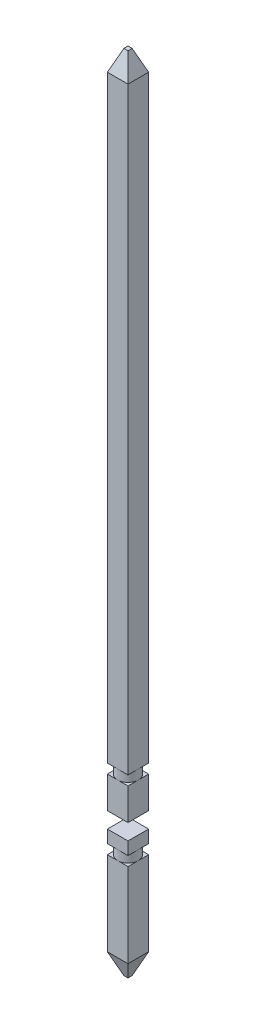
ISO-10303-21;
HEADER;
FILE_DESCRIPTION(('STEP AP214'),'2;1');
FILE_NAME('part.step','',(''),(''),'','','');
FILE_SCHEMA(('AUTOMOTIVE_DESIGN { 1 0 10303 214 1 1 1 1 }'));
ENDSEC;
DATA;
#1=APPLICATION_CONTEXT('core data for automotive mechanical design processes');
#2=APPLICATION_PROTOCOL_DEFINITION('international standard','automotive_design',2000,#1);
#3=PRODUCT_CONTEXT('',#1,'mechanical');
#4=PRODUCT('Part','Part','',(#3));
#5=PRODUCT_RELATED_PRODUCT_CATEGORY('part','',(#4));
#6=PRODUCT_DEFINITION_FORMATION('','',#4);
#7=PRODUCT_DEFINITION_CONTEXT('part definition',#1,'design');
#8=PRODUCT_DEFINITION('design','',#6,#7);
#9=PRODUCT_DEFINITION_SHAPE('','',#8);
#10=(LENGTH_UNIT() NAMED_UNIT(*) SI_UNIT(.MILLI.,.METRE.));
#11=(NAMED_UNIT(*) PLANE_ANGLE_UNIT() SI_UNIT($,.RADIAN.));
#12=(NAMED_UNIT(*) SI_UNIT($,.STERADIAN.) SOLID_ANGLE_UNIT());
#13=UNCERTAINTY_MEASURE_WITH_UNIT(LENGTH_MEASURE(1.E-05),#10,'distance_accuracy_value','');
#14=(GEOMETRIC_REPRESENTATION_CONTEXT(3) GLOBAL_UNCERTAINTY_ASSIGNED_CONTEXT((#13)) GLOBAL_UNIT_ASSIGNED_CONTEXT((#10,
#11,#12)) REPRESENTATION_CONTEXT('',''));
#15=CARTESIAN_POINT('',(0.,0.,0.));
#16=DIRECTION('',(0.,0.,1.));
#17=DIRECTION('',(1.,0.,0.));
#18=AXIS2_PLACEMENT_3D('',#15,#16,#17);
#19=CARTESIAN_POINT('',(-0.325,5.8,-0.325));
#20=DIRECTION('',(0.,1.,0.));
#21=DIRECTION('',(0.,0.,1.));
#22=AXIS2_PLACEMENT_3D('',#19,#20,#21);
#23=PLANE('',#22);
#24=DIRECTION('',(-1.,0.,0.));
#25=VECTOR('',#24,1.);
#26=CARTESIAN_POINT('',(-0.325,5.8,0.325));
#27=LINE('',#26,#25);
#28=CARTESIAN_POINT('',(0.325,5.8,0.325));
#29=VERTEX_POINT('',#28);
#30=CARTESIAN_POINT('',(0.,5.8,0.325));
#31=VERTEX_POINT('',#30);
#32=EDGE_CURVE('E207',#29,#31,#27,.T.);
#33=ORIENTED_EDGE('',*,*,#32,.T.);
#34=CARTESIAN_POINT('',(0.,5.8,0.));
#35=DIRECTION('',(0.,1.,0.));
#36=DIRECTION('',(0.,0.,1.));
#37=AXIS2_PLACEMENT_3D('',#34,#35,#36);
#38=CIRCLE('',#37,0.325);
#39=CARTESIAN_POINT('',(0.325,5.8,0.));
#40=VERTEX_POINT('',#39);
#41=EDGE_CURVE('E190',#31,#40,#38,.T.);
#42=ORIENTED_EDGE('',*,*,#41,.T.);
#43=DIRECTION('',(0.,0.,1.));
#44=VECTOR('',#43,1.);
#45=CARTESIAN_POINT('',(0.325,5.8,-0.325));
#46=LINE('',#45,#44);
#47=EDGE_CURVE('E201',#40,#29,#46,.T.);
#48=ORIENTED_EDGE('',*,*,#47,.T.);
#49=EDGE_LOOP('',(#33,#42,#48));
#50=FACE_BOUND('',#49,.T.);
#51=ADVANCED_FACE('F46',(#50),#23,.F.);
#52=CARTESIAN_POINT('',(0.325,5.8,-0.325));
#53=VERTEX_POINT('',#52);
#54=EDGE_CURVE('E198',#53,#40,#46,.T.);
#55=ORIENTED_EDGE('',*,*,#54,.T.);
#56=CARTESIAN_POINT('',(0.,5.8,-0.325));
#57=VERTEX_POINT('',#56);
#58=EDGE_CURVE('E196',#40,#57,#38,.T.);
#59=ORIENTED_EDGE('',*,*,#58,.T.);
#60=DIRECTION('',(-1.,0.,0.));
#61=VECTOR('',#60,1.);
#62=CARTESIAN_POINT('',(-0.325,5.8,-0.325));
#63=LINE('',#62,#61);
#64=EDGE_CURVE('E211',#53,#57,#63,.T.);
#65=ORIENTED_EDGE('',*,*,#64,.F.);
#66=EDGE_LOOP('',(#55,#59,#65));
#67=FACE_BOUND('',#66,.T.);
#68=ADVANCED_FACE('F295',(#67),#23,.F.);
#69=CARTESIAN_POINT('',(-0.325,5.8,-0.325));
#70=VERTEX_POINT('',#69);
#71=EDGE_CURVE('E215',#57,#70,#63,.T.);
#72=ORIENTED_EDGE('',*,*,#71,.F.);
#73=CARTESIAN_POINT('',(-0.325,5.8,0.));
#74=VERTEX_POINT('',#73);
#75=EDGE_CURVE('E328',#57,#74,#38,.T.);
#76=ORIENTED_EDGE('',*,*,#75,.T.);
#77=DIRECTION('',(0.,0.,1.));
#78=VECTOR('',#77,1.);
#79=CARTESIAN_POINT('',(-0.325,5.8,-0.325));
#80=LINE('',#79,#78);
#81=EDGE_CURVE('E202',#70,#74,#80,.T.);
#82=ORIENTED_EDGE('',*,*,#81,.F.);
#83=EDGE_LOOP('',(#72,#76,#82));
#84=FACE_BOUND('',#83,.T.);
#85=ADVANCED_FACE('F302',(#84),#23,.F.);
#86=CARTESIAN_POINT('',(0.325,25.3,0.325));
#87=DIRECTION('',(-1.,0.,0.));
#88=DIRECTION('',(0.,0.,1.));
#89=AXIS2_PLACEMENT_3D('',#86,#87,#88);
#90=PLANE('',#89);
#91=DIRECTION('',(0.,-1.,0.));
#92=VECTOR('',#91,1.);
#93=CARTESIAN_POINT('',(0.325,25.3,-0.325));
#94=LINE('',#93,#92);
#95=CARTESIAN_POINT('',(0.325,24.65,-0.325));
#96=VERTEX_POINT('',#95);
#97=EDGE_CURVE('E218',#96,#53,#94,.T.);
#98=ORIENTED_EDGE('',*,*,#97,.F.);
#99=DIRECTION('',(0.,0.,1.));
#100=VECTOR('',#99,1.);
#101=CARTESIAN_POINT('',(0.325,24.65,0.325));
#102=LINE('',#101,#100);
#103=CARTESIAN_POINT('',(0.325,24.65,0.325));
#104=VERTEX_POINT('',#103);
#105=EDGE_CURVE('E12',#96,#104,#102,.T.);
#106=ORIENTED_EDGE('',*,*,#105,.T.);
#107=DIRECTION('',(0.,-1.,0.));
#108=VECTOR('',#107,1.);
#109=CARTESIAN_POINT('',(0.325,25.3,0.325));
#110=LINE('',#109,#108);
#111=EDGE_CURVE('E195',#104,#29,#110,.T.);
#112=ORIENTED_EDGE('',*,*,#111,.T.);
#113=ORIENTED_EDGE('',*,*,#47,.F.);
#114=ORIENTED_EDGE('',*,*,#54,.F.);
#115=EDGE_LOOP('',(#98,#106,#112,#113,#114));
#116=FACE_BOUND('',#115,.T.);
#117=ADVANCED_FACE('F317',(#116),#90,.F.);
#118=CARTESIAN_POINT('',(-0.325,25.3,-0.325));
#119=DIRECTION('',(0.,0.,1.));
#120=DIRECTION('',(1.,0.,0.));
#121=AXIS2_PLACEMENT_3D('',#118,#119,#120);
#122=PLANE('',#121);
#123=DIRECTION('',(0.,-1.,0.));
#124=VECTOR('',#123,1.);
#125=CARTESIAN_POINT('',(-0.325,25.3,-0.325));
#126=LINE('',#125,#124);
#127=CARTESIAN_POINT('',(-0.325,24.65,-0.325));
#128=VERTEX_POINT('',#127);
#129=EDGE_CURVE('E214',#128,#70,#126,.T.);
#130=ORIENTED_EDGE('',*,*,#129,.F.);
#131=DIRECTION('',(1.,0.,0.));
#132=VECTOR('',#131,1.);
#133=CARTESIAN_POINT('',(-0.325,24.65,-0.325));
#134=LINE('',#133,#132);
#135=EDGE_CURVE('E230',#128,#96,#134,.T.);
#136=ORIENTED_EDGE('',*,*,#135,.T.);
#137=ORIENTED_EDGE('',*,*,#97,.T.);
#138=ORIENTED_EDGE('',*,*,#64,.T.);
#139=ORIENTED_EDGE('',*,*,#71,.T.);
#140=EDGE_LOOP('',(#130,#136,#137,#138,#139));
#141=FACE_BOUND('',#140,.T.);
#142=ADVANCED_FACE('F322',(#141),#122,.F.);
#143=CARTESIAN_POINT('',(-0.325,25.3,0.325));
#144=DIRECTION('',(1.,0.,0.));
#145=DIRECTION('',(0.,0.,-1.));
#146=AXIS2_PLACEMENT_3D('',#143,#144,#145);
#147=PLANE('',#146);
#148=DIRECTION('',(0.,-1.,0.));
#149=VECTOR('',#148,1.);
#150=CARTESIAN_POINT('',(-0.325,25.3,0.325));
#151=LINE('',#150,#149);
#152=CARTESIAN_POINT('',(-0.325,24.65,0.325));
#153=VERTEX_POINT('',#152);
#154=CARTESIAN_POINT('',(-0.325,5.8,0.325));
#155=VERTEX_POINT('',#154);
#156=EDGE_CURVE('E205',#153,#155,#151,.T.);
#157=ORIENTED_EDGE('',*,*,#156,.F.);
#158=DIRECTION('',(0.,0.,-1.));
#159=VECTOR('',#158,1.);
#160=CARTESIAN_POINT('',(-0.325,24.65,0.325));
#161=LINE('',#160,#159);
#162=EDGE_CURVE('E233',#153,#128,#161,.T.);
#163=ORIENTED_EDGE('',*,*,#162,.T.);
#164=ORIENTED_EDGE('',*,*,#129,.T.);
#165=ORIENTED_EDGE('',*,*,#81,.T.);
#166=EDGE_CURVE('E206',#74,#155,#80,.T.);
#167=ORIENTED_EDGE('',*,*,#166,.T.);
#168=EDGE_LOOP('',(#157,#163,#164,#165,#167));
#169=FACE_BOUND('',#168,.T.);
#170=ADVANCED_FACE('F342',(#169),#147,.F.);
#171=CARTESIAN_POINT('',(-0.325,25.3,0.325));
#172=DIRECTION('',(0.,0.,-1.));
#173=DIRECTION('',(-1.,0.,0.));
#174=AXIS2_PLACEMENT_3D('',#171,#172,#173);
#175=PLANE('',#174);
#176=ORIENTED_EDGE('',*,*,#111,.F.);
#177=DIRECTION('',(-1.,0.,0.));
#178=VECTOR('',#177,1.);
#179=CARTESIAN_POINT('',(-0.325,24.65,0.325));
#180=LINE('',#179,#178);
#181=EDGE_CURVE('E56',#104,#153,#180,.T.);
#182=ORIENTED_EDGE('',*,*,#181,.T.);
#183=ORIENTED_EDGE('',*,*,#156,.T.);
#184=EDGE_CURVE('E210',#31,#155,#27,.T.);
#185=ORIENTED_EDGE('',*,*,#184,.F.);
#186=ORIENTED_EDGE('',*,*,#32,.F.);
#187=EDGE_LOOP('',(#176,#182,#183,#185,#186));
#188=FACE_BOUND('',#187,.T.);
#189=ADVANCED_FACE('F313',(#188),#175,.F.);
#190=CARTESIAN_POINT('',(0.,25.3,0.));
#191=DIRECTION('',(0.,-1.,0.));
#192=DIRECTION('',(0.,0.,-1.));
#193=AXIS2_PLACEMENT_3D('',#190,#191,#192);
#194=PLANE('',#193);
#195=DIRECTION('',(0.,0.,-1.));
#196=VECTOR('',#195,1.);
#197=CARTESIAN_POINT('',(0.065000000000001,25.3,0.));
#198=LINE('',#197,#196);
#199=CARTESIAN_POINT('',(0.065000000000001,25.3,0.065000000000001));
#200=VERTEX_POINT('',#199);
#201=CARTESIAN_POINT('',(0.065000000000001,25.3,-0.065000000000001));
#202=VERTEX_POINT('',#201);
#203=EDGE_CURVE('E221',#200,#202,#198,.T.);
#204=ORIENTED_EDGE('',*,*,#203,.T.);
#205=DIRECTION('',(-1.,0.,0.));
#206=VECTOR('',#205,1.);
#207=CARTESIAN_POINT('',(0.,25.3,-0.065000000000001));
#208=LINE('',#207,#206);
#209=CARTESIAN_POINT('',(-0.065000000000001,25.3,-0.065000000000001));
#210=VERTEX_POINT('',#209);
#211=EDGE_CURVE('E227',#202,#210,#208,.T.);
#212=ORIENTED_EDGE('',*,*,#211,.T.);
#213=DIRECTION('',(0.,0.,1.));
#214=VECTOR('',#213,1.);
#215=CARTESIAN_POINT('',(-0.065000000000001,25.3,0.));
#216=LINE('',#215,#214);
#217=CARTESIAN_POINT('',(-0.065000000000001,25.3,0.065000000000001));
#218=VERTEX_POINT('',#217);
#219=EDGE_CURVE('E225',#210,#218,#216,.T.);
#220=ORIENTED_EDGE('',*,*,#219,.T.);
#221=DIRECTION('',(1.,0.,0.));
#222=VECTOR('',#221,1.);
#223=CARTESIAN_POINT('',(0.,25.3,0.065000000000001));
#224=LINE('',#223,#222);
#225=EDGE_CURVE('E223',#218,#200,#224,.T.);
#226=ORIENTED_EDGE('',*,*,#225,.T.);
#227=EDGE_LOOP('',(#204,#212,#220,#226));
#228=FACE_BOUND('',#227,.T.);
#229=ADVANCED_FACE('F307',(#228),#194,.F.);
#230=ORIENTED_EDGE('',*,*,#166,.F.);
#231=EDGE_CURVE('E197',#74,#31,#38,.T.);
#232=ORIENTED_EDGE('',*,*,#231,.T.);
#233=ORIENTED_EDGE('',*,*,#184,.T.);
#234=EDGE_LOOP('',(#230,#232,#233));
#235=FACE_BOUND('',#234,.T.);
#236=ADVANCED_FACE('F298',(#235),#23,.F.);
#237=CARTESIAN_POINT('',(0.,6.71923881554251,0.));
#238=DIRECTION('',(0.,-1.,0.));
#239=DIRECTION('',(0.,0.,-1.));
#240=AXIS2_PLACEMENT_3D('',#237,#238,#239);
#241=CYLINDRICAL_SURFACE('',#240,0.325);
#242=CARTESIAN_POINT('',(0.,5.5,0.));
#243=DIRECTION('',(0.,1.,0.));
#244=DIRECTION('',(0.,0.,1.));
#245=AXIS2_PLACEMENT_3D('',#242,#243,#244);
#246=CIRCLE('',#245,0.325);
#247=CARTESIAN_POINT('',(0.,5.5,0.325));
#248=VERTEX_POINT('',#247);
#249=CARTESIAN_POINT('',(0.325,5.5,0.));
#250=VERTEX_POINT('',#249);
#251=EDGE_CURVE('E187',#248,#250,#246,.T.);
#252=ORIENTED_EDGE('',*,*,#251,.T.);
#253=CARTESIAN_POINT('',(0.,5.5,-0.325));
#254=VERTEX_POINT('',#253);
#255=EDGE_CURVE('E191',#250,#254,#246,.T.);
#256=ORIENTED_EDGE('',*,*,#255,.T.);
#257=CARTESIAN_POINT('',(-0.325,5.5,0.));
#258=VERTEX_POINT('',#257);
#259=EDGE_CURVE('E153',#254,#258,#246,.T.);
#260=ORIENTED_EDGE('',*,*,#259,.T.);
#261=EDGE_CURVE('E192',#258,#248,#246,.T.);
#262=ORIENTED_EDGE('',*,*,#261,.T.);
#263=EDGE_LOOP('',(#252,#256,#260,#262));
#264=FACE_BOUND('',#263,.T.);
#265=ORIENTED_EDGE('',*,*,#41,.F.);
#266=ORIENTED_EDGE('',*,*,#231,.F.);
#267=ORIENTED_EDGE('',*,*,#75,.F.);
#268=ORIENTED_EDGE('',*,*,#58,.F.);
#269=EDGE_LOOP('',(#265,#266,#267,#268));
#270=FACE_BOUND('',#269,.T.);
#271=ADVANCED_FACE('F276',(#264,#270),#241,.T.);
#272=CARTESIAN_POINT('',(-0.325,5.5,-0.325));
#273=DIRECTION('',(0.,-1.,0.));
#274=DIRECTION('',(0.,0.,-1.));
#275=AXIS2_PLACEMENT_3D('',#272,#273,#274);
#276=PLANE('',#275);
#277=ORIENTED_EDGE('',*,*,#251,.F.);
#278=DIRECTION('',(1.,0.,0.));
#279=VECTOR('',#278,1.);
#280=CARTESIAN_POINT('',(-0.325,5.5,0.325));
#281=LINE('',#280,#279);
#282=CARTESIAN_POINT('',(0.325,5.5,0.325));
#283=VERTEX_POINT('',#282);
#284=EDGE_CURVE('E246',#248,#283,#281,.T.);
#285=ORIENTED_EDGE('',*,*,#284,.T.);
#286=DIRECTION('',(0.,0.,1.));
#287=VECTOR('',#286,1.);
#288=CARTESIAN_POINT('',(0.325,5.5,-0.325));
#289=LINE('',#288,#287);
#290=EDGE_CURVE('E168',#250,#283,#289,.T.);
#291=ORIENTED_EDGE('',*,*,#290,.F.);
#292=EDGE_LOOP('',(#277,#285,#291));
#293=FACE_BOUND('',#292,.T.);
#294=ADVANCED_FACE('F282',(#293),#276,.F.);
#295=ORIENTED_EDGE('',*,*,#255,.F.);
#296=CARTESIAN_POINT('',(0.325,5.5,-0.325));
#297=VERTEX_POINT('',#296);
#298=EDGE_CURVE('E186',#297,#250,#289,.T.);
#299=ORIENTED_EDGE('',*,*,#298,.F.);
#300=DIRECTION('',(1.,0.,0.));
#301=VECTOR('',#300,1.);
#302=CARTESIAN_POINT('',(-0.325,5.5,-0.325));
#303=LINE('',#302,#301);
#304=EDGE_CURVE('E159',#254,#297,#303,.T.);
#305=ORIENTED_EDGE('',*,*,#304,.F.);
#306=EDGE_LOOP('',(#295,#299,#305));
#307=FACE_BOUND('',#306,.T.);
#308=ADVANCED_FACE('F280',(#307),#276,.F.);
#309=ORIENTED_EDGE('',*,*,#259,.F.);
#310=CARTESIAN_POINT('',(-0.325,5.5,-0.325));
#311=VERTEX_POINT('',#310);
#312=EDGE_CURVE('E148',#311,#254,#303,.T.);
#313=ORIENTED_EDGE('',*,*,#312,.F.);
#314=DIRECTION('',(0.,0.,1.));
#315=VECTOR('',#314,1.);
#316=CARTESIAN_POINT('',(-0.325,5.5,-0.325));
#317=LINE('',#316,#315);
#318=EDGE_CURVE('E151',#311,#258,#317,.T.);
#319=ORIENTED_EDGE('',*,*,#318,.T.);
#320=EDGE_LOOP('',(#309,#313,#319));
#321=FACE_BOUND('',#320,.T.);
#322=ADVANCED_FACE('F150',(#321),#276,.F.);
#323=CARTESIAN_POINT('',(-0.325,4.5,-0.325));
#324=DIRECTION('',(0.,1.,0.));
#325=DIRECTION('',(0.,0.,1.));
#326=AXIS2_PLACEMENT_3D('',#323,#324,#325);
#327=PLANE('',#326);
#328=DIRECTION('',(-1.,0.,0.));
#329=VECTOR('',#328,1.);
#330=CARTESIAN_POINT('',(-0.325,4.5,0.325));
#331=LINE('',#330,#329);
#332=CARTESIAN_POINT('',(0.325,4.5,0.325));
#333=VERTEX_POINT('',#332);
#334=CARTESIAN_POINT('',(-0.325,4.5,0.325));
#335=VERTEX_POINT('',#334);
#336=EDGE_CURVE('E183',#333,#335,#331,.T.);
#337=ORIENTED_EDGE('',*,*,#336,.T.);
#338=DIRECTION('',(0.,0.,1.));
#339=VECTOR('',#338,1.);
#340=CARTESIAN_POINT('',(-0.325,4.5,-0.325));
#341=LINE('',#340,#339);
#342=CARTESIAN_POINT('',(-0.325,4.5,-0.325));
#343=VERTEX_POINT('',#342);
#344=EDGE_CURVE('E174',#343,#335,#341,.T.);
#345=ORIENTED_EDGE('',*,*,#344,.F.);
#346=DIRECTION('',(-1.,0.,0.));
#347=VECTOR('',#346,1.);
#348=CARTESIAN_POINT('',(-0.325,4.5,-0.325));
#349=LINE('',#348,#347);
#350=CARTESIAN_POINT('',(0.325,4.5,-0.325));
#351=VERTEX_POINT('',#350);
#352=EDGE_CURVE('E173',#351,#343,#349,.T.);
#353=ORIENTED_EDGE('',*,*,#352,.F.);
#354=DIRECTION('',(0.,0.,1.));
#355=VECTOR('',#354,1.);
#356=CARTESIAN_POINT('',(0.325,4.5,-0.325));
#357=LINE('',#356,#355);
#358=EDGE_CURVE('E261',#351,#333,#357,.T.);
#359=ORIENTED_EDGE('',*,*,#358,.T.);
#360=EDGE_LOOP('',(#337,#345,#353,#359));
#361=FACE_BOUND('',#360,.T.);
#362=ADVANCED_FACE('F267',(#361),#327,.F.);
#363=CARTESIAN_POINT('',(-0.325,25.3,0.325));
#364=DIRECTION('',(0.,0.,-1.));
#365=DIRECTION('',(-1.,0.,0.));
#366=AXIS2_PLACEMENT_3D('',#363,#364,#365);
#367=PLANE('',#366);
#368=DIRECTION('',(0.,-1.,0.));
#369=VECTOR('',#368,1.);
#370=CARTESIAN_POINT('',(0.325,25.3,0.325));
#371=LINE('',#370,#369);
#372=EDGE_CURVE('E184',#283,#333,#371,.T.);
#373=ORIENTED_EDGE('',*,*,#372,.F.);
#374=ORIENTED_EDGE('',*,*,#284,.F.);
#375=CARTESIAN_POINT('',(-0.325,5.5,0.325));
#376=VERTEX_POINT('',#375);
#377=EDGE_CURVE('E251',#376,#248,#281,.T.);
#378=ORIENTED_EDGE('',*,*,#377,.F.);
#379=DIRECTION('',(0.,-1.,0.));
#380=VECTOR('',#379,1.);
#381=CARTESIAN_POINT('',(-0.325,25.3,0.325));
#382=LINE('',#381,#380);
#383=EDGE_CURVE('E176',#376,#335,#382,.T.);
#384=ORIENTED_EDGE('',*,*,#383,.T.);
#385=ORIENTED_EDGE('',*,*,#336,.F.);
#386=EDGE_LOOP('',(#373,#374,#378,#384,#385));
#387=FACE_BOUND('',#386,.T.);
#388=ADVANCED_FACE('F271',(#387),#367,.F.);
#389=CARTESIAN_POINT('',(-0.325,25.3,0.325));
#390=DIRECTION('',(1.,0.,0.));
#391=DIRECTION('',(0.,0.,-1.));
#392=AXIS2_PLACEMENT_3D('',#389,#390,#391);
#393=PLANE('',#392);
#394=ORIENTED_EDGE('',*,*,#383,.F.);
#395=EDGE_CURVE('E158',#258,#376,#317,.T.);
#396=ORIENTED_EDGE('',*,*,#395,.F.);
#397=ORIENTED_EDGE('',*,*,#318,.F.);
#398=DIRECTION('',(0.,-1.,0.));
#399=VECTOR('',#398,1.);
#400=CARTESIAN_POINT('',(-0.325,25.3,-0.325));
#401=LINE('',#400,#399);
#402=EDGE_CURVE('E166',#311,#343,#401,.T.);
#403=ORIENTED_EDGE('',*,*,#402,.T.);
#404=ORIENTED_EDGE('',*,*,#344,.T.);
#405=EDGE_LOOP('',(#394,#396,#397,#403,#404));
#406=FACE_BOUND('',#405,.T.);
#407=ADVANCED_FACE('F164',(#406),#393,.F.);
#408=CARTESIAN_POINT('',(-0.325,25.3,-0.325));
#409=DIRECTION('',(0.,0.,1.));
#410=DIRECTION('',(1.,0.,0.));
#411=AXIS2_PLACEMENT_3D('',#408,#409,#410);
#412=PLANE('',#411);
#413=ORIENTED_EDGE('',*,*,#402,.F.);
#414=ORIENTED_EDGE('',*,*,#312,.T.);
#415=ORIENTED_EDGE('',*,*,#304,.T.);
#416=DIRECTION('',(0.,-1.,0.));
#417=VECTOR('',#416,1.);
#418=CARTESIAN_POINT('',(0.325,25.3,-0.325));
#419=LINE('',#418,#417);
#420=EDGE_CURVE('E178',#297,#351,#419,.T.);
#421=ORIENTED_EDGE('',*,*,#420,.T.);
#422=ORIENTED_EDGE('',*,*,#352,.T.);
#423=EDGE_LOOP('',(#413,#414,#415,#421,#422));
#424=FACE_BOUND('',#423,.T.);
#425=ADVANCED_FACE('F171',(#424),#412,.F.);
#426=CARTESIAN_POINT('',(0.325,25.3,0.325));
#427=DIRECTION('',(-1.,0.,0.));
#428=DIRECTION('',(0.,0.,1.));
#429=AXIS2_PLACEMENT_3D('',#426,#427,#428);
#430=PLANE('',#429);
#431=ORIENTED_EDGE('',*,*,#420,.F.);
#432=ORIENTED_EDGE('',*,*,#298,.T.);
#433=ORIENTED_EDGE('',*,*,#290,.T.);
#434=ORIENTED_EDGE('',*,*,#372,.T.);
#435=ORIENTED_EDGE('',*,*,#358,.F.);
#436=EDGE_LOOP('',(#431,#432,#433,#434,#435));
#437=FACE_BOUND('',#436,.T.);
#438=ADVANCED_FACE('F284',(#437),#430,.F.);
#439=ORIENTED_EDGE('',*,*,#261,.F.);
#440=ORIENTED_EDGE('',*,*,#395,.T.);
#441=ORIENTED_EDGE('',*,*,#377,.T.);
#442=EDGE_LOOP('',(#439,#440,#441));
#443=FACE_BOUND('',#442,.T.);
#444=ADVANCED_FACE('F273',(#443),#276,.F.);
#445=CARTESIAN_POINT('',(0.,25.3,0.065000000000001));
#446=DIRECTION('',(0.,-0.3713906763541,-0.928476690885261));
#447=DIRECTION('',(1.,0.,0.));
#448=AXIS2_PLACEMENT_3D('',#445,#446,#447);
#449=PLANE('',#448);
#450=DIRECTION('',(-0.348155311911393,-0.870388279778491,0.348155311911393));
#451=VECTOR('',#450,1.);
#452=CARTESIAN_POINT('',(-0.0571212121212132,25.319696969697,0.0571212121212132));
#453=LINE('',#452,#451);
#454=EDGE_CURVE('E239',#153,#218,#453,.F.);
#455=ORIENTED_EDGE('',*,*,#454,.F.);
#456=ORIENTED_EDGE('',*,*,#181,.F.);
#457=DIRECTION('',(0.348155311911393,-0.870388279778491,0.348155311911393));
#458=VECTOR('',#457,1.);
#459=CARTESIAN_POINT('',(0.0571212121212132,25.319696969697,0.0571212121212132));
#460=LINE('',#459,#458);
#461=EDGE_CURVE('E51',#200,#104,#460,.T.);
#462=ORIENTED_EDGE('',*,*,#461,.F.);
#463=ORIENTED_EDGE('',*,*,#225,.F.);
#464=EDGE_LOOP('',(#455,#456,#462,#463));
#465=FACE_BOUND('',#464,.T.);
#466=ADVANCED_FACE('F49',(#465),#449,.F.);
#467=CARTESIAN_POINT('',(0.065000000000001,25.3,0.));
#468=DIRECTION('',(-0.928476690885261,-0.3713906763541,0.));
#469=DIRECTION('',(0.,0.,-1.));
#470=AXIS2_PLACEMENT_3D('',#467,#468,#469);
#471=PLANE('',#470);
#472=ORIENTED_EDGE('',*,*,#461,.T.);
#473=ORIENTED_EDGE('',*,*,#105,.F.);
#474=DIRECTION('',(-0.348155311911393,0.870388279778491,0.348155311911393));
#475=VECTOR('',#474,1.);
#476=CARTESIAN_POINT('',(0.0571212121212132,25.319696969697,-0.0571212121212132));
#477=LINE('',#476,#475);
#478=EDGE_CURVE('E238',#202,#96,#477,.F.);
#479=ORIENTED_EDGE('',*,*,#478,.F.);
#480=ORIENTED_EDGE('',*,*,#203,.F.);
#481=EDGE_LOOP('',(#472,#473,#479,#480));
#482=FACE_BOUND('',#481,.T.);
#483=ADVANCED_FACE('F351',(#482),#471,.F.);
#484=CARTESIAN_POINT('',(-0.065000000000001,25.3,0.));
#485=DIRECTION('',(0.928476690885261,-0.3713906763541,0.));
#486=DIRECTION('',(0.,0.,1.));
#487=AXIS2_PLACEMENT_3D('',#484,#485,#486);
#488=PLANE('',#487);
#489=ORIENTED_EDGE('',*,*,#454,.T.);
#490=ORIENTED_EDGE('',*,*,#219,.F.);
#491=DIRECTION('',(-0.348155311911393,-0.870388279778491,-0.348155311911393));
#492=VECTOR('',#491,1.);
#493=CARTESIAN_POINT('',(-0.0571212121212132,25.319696969697,-0.0571212121212132));
#494=LINE('',#493,#492);
#495=EDGE_CURVE('E236',#128,#210,#494,.F.);
#496=ORIENTED_EDGE('',*,*,#495,.F.);
#497=ORIENTED_EDGE('',*,*,#162,.F.);
#498=EDGE_LOOP('',(#489,#490,#496,#497));
#499=FACE_BOUND('',#498,.T.);
#500=ADVANCED_FACE('F349',(#499),#488,.F.);
#501=CARTESIAN_POINT('',(0.,25.3,-0.065000000000001));
#502=DIRECTION('',(0.,-0.3713906763541,0.928476690885261));
#503=DIRECTION('',(-1.,0.,0.));
#504=AXIS2_PLACEMENT_3D('',#501,#502,#503);
#505=PLANE('',#504);
#506=ORIENTED_EDGE('',*,*,#478,.T.);
#507=ORIENTED_EDGE('',*,*,#135,.F.);
#508=ORIENTED_EDGE('',*,*,#495,.T.);
#509=ORIENTED_EDGE('',*,*,#211,.F.);
#510=EDGE_LOOP('',(#506,#507,#508,#509));
#511=FACE_BOUND('',#510,.T.);
#512=ADVANCED_FACE('F346',(#511),#505,.F.);
#513=CLOSED_SHELL('',(#51,#68,#85,#117,#142,#170,#189,#229,#236,#271,#294,#308,#322,#362,#388,
#407,#425,#438,#444,#466,#483,#500,#512));
#514=MANIFOLD_SOLID_BREP('B2',#513);
#515=CARTESIAN_POINT('',(-0.325,3.3,-0.325));
#516=DIRECTION('',(0.,-1.,0.));
#517=DIRECTION('',(0.,0.,-1.));
#518=AXIS2_PLACEMENT_3D('',#515,#516,#517);
#519=PLANE('',#518);
#520=CARTESIAN_POINT('',(0.,3.3,0.));
#521=DIRECTION('',(0.,1.,0.));
#522=DIRECTION('',(0.,0.,1.));
#523=AXIS2_PLACEMENT_3D('',#520,#521,#522);
#524=CIRCLE('',#523,0.325);
#525=CARTESIAN_POINT('',(0.,3.3,0.325));
#526=VERTEX_POINT('',#525);
#527=CARTESIAN_POINT('',(0.325,3.3,0.));
#528=VERTEX_POINT('',#527);
#529=EDGE_CURVE('E641',#526,#528,#524,.T.);
#530=ORIENTED_EDGE('',*,*,#529,.F.);
#531=DIRECTION('',(1.,0.,0.));
#532=VECTOR('',#531,1.);
#533=CARTESIAN_POINT('',(-0.325,3.3,0.325));
#534=LINE('',#533,#532);
#535=CARTESIAN_POINT('',(0.325,3.3,0.325));
#536=VERTEX_POINT('',#535);
#537=EDGE_CURVE('E670',#526,#536,#534,.T.);
#538=ORIENTED_EDGE('',*,*,#537,.T.);
#539=DIRECTION('',(0.,0.,1.));
#540=VECTOR('',#539,1.);
#541=CARTESIAN_POINT('',(0.325,3.3,-0.325));
#542=LINE('',#541,#540);
#543=EDGE_CURVE('E682',#528,#536,#542,.T.);
#544=ORIENTED_EDGE('',*,*,#543,.F.);
#545=EDGE_LOOP('',(#530,#538,#544));
#546=FACE_BOUND('',#545,.T.);
#547=ADVANCED_FACE('F516',(#546),#519,.F.);
#548=CARTESIAN_POINT('',(0.,3.3,-0.325));
#549=VERTEX_POINT('',#548);
#550=EDGE_CURVE('E665',#528,#549,#524,.T.);
#551=ORIENTED_EDGE('',*,*,#550,.F.);
#552=CARTESIAN_POINT('',(0.325,3.3,-0.325));
#553=VERTEX_POINT('',#552);
#554=EDGE_CURVE('E678',#553,#528,#542,.T.);
#555=ORIENTED_EDGE('',*,*,#554,.F.);
#556=DIRECTION('',(1.,0.,0.));
#557=VECTOR('',#556,1.);
#558=CARTESIAN_POINT('',(-0.325,3.3,-0.325));
#559=LINE('',#558,#557);
#560=EDGE_CURVE('E675',#549,#553,#559,.T.);
#561=ORIENTED_EDGE('',*,*,#560,.F.);
#562=EDGE_LOOP('',(#551,#555,#561));
#563=FACE_BOUND('',#562,.T.);
#564=ADVANCED_FACE('F754',(#563),#519,.F.);
#565=CARTESIAN_POINT('',(-0.325,3.3,0.));
#566=VERTEX_POINT('',#565);
#567=EDGE_CURVE('E743',#549,#566,#524,.T.);
#568=ORIENTED_EDGE('',*,*,#567,.F.);
#569=CARTESIAN_POINT('',(-0.325,3.3,-0.325));
#570=VERTEX_POINT('',#569);
#571=EDGE_CURVE('E671',#570,#549,#559,.T.);
#572=ORIENTED_EDGE('',*,*,#571,.F.);
#573=DIRECTION('',(0.,0.,1.));
#574=VECTOR('',#573,1.);
#575=CARTESIAN_POINT('',(-0.325,3.3,-0.325));
#576=LINE('',#575,#574);
#577=EDGE_CURVE('E683',#570,#566,#576,.T.);
#578=ORIENTED_EDGE('',*,*,#577,.T.);
#579=EDGE_LOOP('',(#568,#572,#578));
#580=FACE_BOUND('',#579,.T.);
#581=ADVANCED_FACE('F742',(#580),#519,.F.);
#582=CARTESIAN_POINT('',(0.,0.,0.));
#583=DIRECTION('',(0.,-1.,0.));
#584=DIRECTION('',(0.,0.,-1.));
#585=AXIS2_PLACEMENT_3D('',#582,#583,#584);
#586=PLANE('',#585);
#587=DIRECTION('',(0.,0.,-1.));
#588=VECTOR('',#587,1.);
#589=CARTESIAN_POINT('',(-0.0649999999999997,0.,-0.325));
#590=LINE('',#589,#588);
#591=CARTESIAN_POINT('',(-0.0649999999999997,0.,0.0649999999999997));
#592=VERTEX_POINT('',#591);
#593=CARTESIAN_POINT('',(-0.0649999999999997,0.,-0.0649999999999997));
#594=VERTEX_POINT('',#593);
#595=EDGE_CURVE('E701',#592,#594,#590,.T.);
#596=ORIENTED_EDGE('',*,*,#595,.T.);
#597=DIRECTION('',(1.,0.,0.));
#598=VECTOR('',#597,1.);
#599=CARTESIAN_POINT('',(0.325,0.,-0.0649999999999997));
#600=LINE('',#599,#598);
#601=CARTESIAN_POINT('',(0.0649999999999997,0.,-0.0649999999999997));
#602=VERTEX_POINT('',#601);
#603=EDGE_CURVE('E703',#594,#602,#600,.T.);
#604=ORIENTED_EDGE('',*,*,#603,.T.);
#605=DIRECTION('',(0.,0.,1.));
#606=VECTOR('',#605,1.);
#607=CARTESIAN_POINT('',(0.0649999999999997,0.,0.325));
#608=LINE('',#607,#606);
#609=CARTESIAN_POINT('',(0.0649999999999997,0.,0.0649999999999997));
#610=VERTEX_POINT('',#609);
#611=EDGE_CURVE('E697',#602,#610,#608,.T.);
#612=ORIENTED_EDGE('',*,*,#611,.T.);
#613=DIRECTION('',(-1.,0.,0.));
#614=VECTOR('',#613,1.);
#615=CARTESIAN_POINT('',(-0.325,0.,0.0649999999999997));
#616=LINE('',#615,#614);
#617=EDGE_CURVE('E699',#610,#592,#616,.T.);
#618=ORIENTED_EDGE('',*,*,#617,.T.);
#619=EDGE_LOOP('',(#596,#604,#612,#618));
#620=FACE_BOUND('',#619,.T.);
#621=ADVANCED_FACE('F726',(#620),#586,.T.);
#622=CARTESIAN_POINT('',(0.325,25.3,0.325));
#623=DIRECTION('',(-1.,0.,0.));
#624=DIRECTION('',(0.,0.,1.));
#625=AXIS2_PLACEMENT_3D('',#622,#623,#624);
#626=PLANE('',#625);
#627=DIRECTION('',(0.,-1.,0.));
#628=VECTOR('',#627,1.);
#629=CARTESIAN_POINT('',(0.325,25.3,0.325));
#630=LINE('',#629,#628);
#631=CARTESIAN_POINT('',(0.325,0.650000000000005,0.325));
#632=VERTEX_POINT('',#631);
#633=EDGE_CURVE('E681',#536,#632,#630,.T.);
#634=ORIENTED_EDGE('',*,*,#633,.T.);
#635=DIRECTION('',(0.,0.,-1.));
#636=VECTOR('',#635,1.);
#637=CARTESIAN_POINT('',(0.325,0.650000000000005,-0.325));
#638=LINE('',#637,#636);
#639=CARTESIAN_POINT('',(0.325,0.650000000000005,-0.325));
#640=VERTEX_POINT('',#639);
#641=EDGE_CURVE('E44',#632,#640,#638,.T.);
#642=ORIENTED_EDGE('',*,*,#641,.T.);
#643=DIRECTION('',(0.,-1.,0.));
#644=VECTOR('',#643,1.);
#645=CARTESIAN_POINT('',(0.325,25.3,-0.325));
#646=LINE('',#645,#644);
#647=EDGE_CURVE('E691',#553,#640,#646,.T.);
#648=ORIENTED_EDGE('',*,*,#647,.F.);
#649=ORIENTED_EDGE('',*,*,#554,.T.);
#650=ORIENTED_EDGE('',*,*,#543,.T.);
#651=EDGE_LOOP('',(#634,#642,#648,#649,#650));
#652=FACE_BOUND('',#651,.T.);
#653=ADVANCED_FACE('F759',(#652),#626,.F.);
#654=CARTESIAN_POINT('',(-0.325,25.3,-0.325));
#655=DIRECTION('',(0.,0.,1.));
#656=DIRECTION('',(1.,0.,0.));
#657=AXIS2_PLACEMENT_3D('',#654,#655,#656);
#658=PLANE('',#657);
#659=ORIENTED_EDGE('',*,*,#647,.T.);
#660=DIRECTION('',(-1.,0.,0.));
#661=VECTOR('',#660,1.);
#662=CARTESIAN_POINT('',(-0.325,0.650000000000005,-0.325));
#663=LINE('',#662,#661);
#664=CARTESIAN_POINT('',(-0.325,0.650000000000005,-0.325));
#665=VERTEX_POINT('',#664);
#666=EDGE_CURVE('E694',#640,#665,#663,.T.);
#667=ORIENTED_EDGE('',*,*,#666,.T.);
#668=DIRECTION('',(0.,-1.,0.));
#669=VECTOR('',#668,1.);
#670=CARTESIAN_POINT('',(-0.325,25.3,-0.325));
#671=LINE('',#670,#669);
#672=EDGE_CURVE('E689',#570,#665,#671,.T.);
#673=ORIENTED_EDGE('',*,*,#672,.F.);
#674=ORIENTED_EDGE('',*,*,#571,.T.);
#675=ORIENTED_EDGE('',*,*,#560,.T.);
#676=EDGE_LOOP('',(#659,#667,#673,#674,#675));
#677=FACE_BOUND('',#676,.T.);
#678=ADVANCED_FACE('F735',(#677),#658,.F.);
#679=CARTESIAN_POINT('',(-0.325,25.3,0.325));
#680=DIRECTION('',(1.,0.,0.));
#681=DIRECTION('',(0.,0.,-1.));
#682=AXIS2_PLACEMENT_3D('',#679,#680,#681);
#683=PLANE('',#682);
#684=ORIENTED_EDGE('',*,*,#672,.T.);
#685=DIRECTION('',(0.,0.,1.));
#686=VECTOR('',#685,1.);
#687=CARTESIAN_POINT('',(-0.325,0.650000000000005,0.325));
#688=LINE('',#687,#686);
#689=CARTESIAN_POINT('',(-0.325,0.650000000000005,0.325));
#690=VERTEX_POINT('',#689);
#691=EDGE_CURVE('E541',#665,#690,#688,.T.);
#692=ORIENTED_EDGE('',*,*,#691,.T.);
#693=DIRECTION('',(0.,-1.,0.));
#694=VECTOR('',#693,1.);
#695=CARTESIAN_POINT('',(-0.325,25.3,0.325));
#696=LINE('',#695,#694);
#697=CARTESIAN_POINT('',(-0.325,3.3,0.325));
#698=VERTEX_POINT('',#697);
#699=EDGE_CURVE('E687',#698,#690,#696,.T.);
#700=ORIENTED_EDGE('',*,*,#699,.F.);
#701=EDGE_CURVE('E674',#566,#698,#576,.T.);
#702=ORIENTED_EDGE('',*,*,#701,.F.);
#703=ORIENTED_EDGE('',*,*,#577,.F.);
#704=EDGE_LOOP('',(#684,#692,#700,#702,#703));
#705=FACE_BOUND('',#704,.T.);
#706=ADVANCED_FACE('F738',(#705),#683,.F.);
#707=CARTESIAN_POINT('',(-0.325,25.3,0.325));
#708=DIRECTION('',(0.,0.,-1.));
#709=DIRECTION('',(-1.,0.,0.));
#710=AXIS2_PLACEMENT_3D('',#707,#708,#709);
#711=PLANE('',#710);
#712=ORIENTED_EDGE('',*,*,#699,.T.);
#713=DIRECTION('',(1.,0.,0.));
#714=VECTOR('',#713,1.);
#715=CARTESIAN_POINT('',(0.325,0.650000000000005,0.325));
#716=LINE('',#715,#714);
#717=EDGE_CURVE('E526',#690,#632,#716,.T.);
#718=ORIENTED_EDGE('',*,*,#717,.T.);
#719=ORIENTED_EDGE('',*,*,#633,.F.);
#720=ORIENTED_EDGE('',*,*,#537,.F.);
#721=EDGE_CURVE('E676',#698,#526,#534,.T.);
#722=ORIENTED_EDGE('',*,*,#721,.F.);
#723=EDGE_LOOP('',(#712,#718,#719,#720,#722));
#724=FACE_BOUND('',#723,.T.);
#725=ADVANCED_FACE('F760',(#724),#711,.F.);
#726=EDGE_CURVE('E666',#566,#526,#524,.T.);
#727=ORIENTED_EDGE('',*,*,#726,.F.);
#728=ORIENTED_EDGE('',*,*,#701,.T.);
#729=ORIENTED_EDGE('',*,*,#721,.T.);
#730=EDGE_LOOP('',(#727,#728,#729));
#731=FACE_BOUND('',#730,.T.);
#732=ADVANCED_FACE('F763',(#731),#519,.F.);
#733=CARTESIAN_POINT('',(0.,4.51923881554251,0.));
#734=DIRECTION('',(0.,-1.,0.));
#735=DIRECTION('',(0.,0.,-1.));
#736=AXIS2_PLACEMENT_3D('',#733,#734,#735);
#737=CYLINDRICAL_SURFACE('',#736,0.325);
#738=ORIENTED_EDGE('',*,*,#529,.T.);
#739=ORIENTED_EDGE('',*,*,#550,.T.);
#740=ORIENTED_EDGE('',*,*,#567,.T.);
#741=ORIENTED_EDGE('',*,*,#726,.T.);
#742=EDGE_LOOP('',(#738,#739,#740,#741));
#743=FACE_BOUND('',#742,.T.);
#744=CARTESIAN_POINT('',(0.,3.6,0.));
#745=DIRECTION('',(0.,1.,0.));
#746=DIRECTION('',(0.,0.,1.));
#747=AXIS2_PLACEMENT_3D('',#744,#745,#746);
#748=CIRCLE('',#747,0.325);
#749=CARTESIAN_POINT('',(0.,3.6,0.325));
#750=VERTEX_POINT('',#749);
#751=CARTESIAN_POINT('',(0.325,3.6,0.));
#752=VERTEX_POINT('',#751);
#753=EDGE_CURVE('E667',#750,#752,#748,.T.);
#754=ORIENTED_EDGE('',*,*,#753,.F.);
#755=CARTESIAN_POINT('',(-0.325,3.6,0.));
#756=VERTEX_POINT('',#755);
#757=EDGE_CURVE('E664',#756,#750,#748,.T.);
#758=ORIENTED_EDGE('',*,*,#757,.F.);
#759=CARTESIAN_POINT('',(0.,3.6,-0.325));
#760=VERTEX_POINT('',#759);
#761=EDGE_CURVE('E983',#760,#756,#748,.T.);
#762=ORIENTED_EDGE('',*,*,#761,.F.);
#763=EDGE_CURVE('E626',#752,#760,#748,.T.);
#764=ORIENTED_EDGE('',*,*,#763,.F.);
#765=EDGE_LOOP('',(#754,#758,#762,#764));
#766=FACE_BOUND('',#765,.T.);
#767=ADVANCED_FACE('F748',(#743,#766),#737,.T.);
#768=CARTESIAN_POINT('',(-0.325,3.6,-0.325));
#769=DIRECTION('',(0.,1.,0.));
#770=DIRECTION('',(0.,0.,1.));
#771=AXIS2_PLACEMENT_3D('',#768,#769,#770);
#772=PLANE('',#771);
#773=DIRECTION('',(-1.,0.,0.));
#774=VECTOR('',#773,1.);
#775=CARTESIAN_POINT('',(-0.325,3.6,0.325));
#776=LINE('',#775,#774);
#777=CARTESIAN_POINT('',(0.325,3.6,0.325));
#778=VERTEX_POINT('',#777);
#779=EDGE_CURVE('E974',#778,#750,#776,.T.);
#780=ORIENTED_EDGE('',*,*,#779,.T.);
#781=ORIENTED_EDGE('',*,*,#753,.T.);
#782=DIRECTION('',(0.,0.,1.));
#783=VECTOR('',#782,1.);
#784=CARTESIAN_POINT('',(0.325,3.6,-0.325));
#785=LINE('',#784,#783);
#786=EDGE_CURVE('E640',#752,#778,#785,.T.);
#787=ORIENTED_EDGE('',*,*,#786,.T.);
#788=EDGE_LOOP('',(#780,#781,#787));
#789=FACE_BOUND('',#788,.T.);
#790=ADVANCED_FACE('F770',(#789),#772,.F.);
#791=CARTESIAN_POINT('',(0.325,3.6,-0.325));
#792=VERTEX_POINT('',#791);
#793=EDGE_CURVE('E625',#792,#752,#785,.T.);
#794=ORIENTED_EDGE('',*,*,#793,.T.);
#795=ORIENTED_EDGE('',*,*,#763,.T.);
#796=DIRECTION('',(-1.,0.,0.));
#797=VECTOR('',#796,1.);
#798=CARTESIAN_POINT('',(-0.325,3.6,-0.325));
#799=LINE('',#798,#797);
#800=EDGE_CURVE('E622',#792,#760,#799,.T.);
#801=ORIENTED_EDGE('',*,*,#800,.F.);
#802=EDGE_LOOP('',(#794,#795,#801));
#803=FACE_BOUND('',#802,.T.);
#804=ADVANCED_FACE('F624',(#803),#772,.F.);
#805=CARTESIAN_POINT('',(-0.325,3.6,-0.325));
#806=VERTEX_POINT('',#805);
#807=EDGE_CURVE('E631',#760,#806,#799,.T.);
#808=ORIENTED_EDGE('',*,*,#807,.F.);
#809=ORIENTED_EDGE('',*,*,#761,.T.);
#810=DIRECTION('',(0.,0.,1.));
#811=VECTOR('',#810,1.);
#812=CARTESIAN_POINT('',(-0.325,3.6,-0.325));
#813=LINE('',#812,#811);
#814=EDGE_CURVE('E646',#806,#756,#813,.T.);
#815=ORIENTED_EDGE('',*,*,#814,.F.);
#816=EDGE_LOOP('',(#808,#809,#815));
#817=FACE_BOUND('',#816,.T.);
#818=ADVANCED_FACE('F809',(#817),#772,.F.);
#819=CARTESIAN_POINT('',(-0.325,3.6,0.325));
#820=VERTEX_POINT('',#819);
#821=EDGE_CURVE('E649',#756,#820,#813,.T.);
#822=ORIENTED_EDGE('',*,*,#821,.F.);
#823=ORIENTED_EDGE('',*,*,#757,.T.);
#824=EDGE_CURVE('E976',#750,#820,#776,.T.);
#825=ORIENTED_EDGE('',*,*,#824,.T.);
#826=EDGE_LOOP('',(#822,#823,#825));
#827=FACE_BOUND('',#826,.T.);
#828=ADVANCED_FACE('F801',(#827),#772,.F.);
#829=CARTESIAN_POINT('',(-0.325,25.3,0.325));
#830=DIRECTION('',(0.,0.,-1.));
#831=DIRECTION('',(-1.,0.,0.));
#832=AXIS2_PLACEMENT_3D('',#829,#830,#831);
#833=PLANE('',#832);
#834=DIRECTION('',(0.,-1.,0.));
#835=VECTOR('',#834,1.);
#836=CARTESIAN_POINT('',(-0.325,25.3,0.325));
#837=LINE('',#836,#835);
#838=CARTESIAN_POINT('',(-0.325,4.,0.325));
#839=VERTEX_POINT('',#838);
#840=EDGE_CURVE('E656',#839,#820,#837,.T.);
#841=ORIENTED_EDGE('',*,*,#840,.T.);
#842=ORIENTED_EDGE('',*,*,#824,.F.);
#843=ORIENTED_EDGE('',*,*,#779,.F.);
#844=DIRECTION('',(0.,-1.,0.));
#845=VECTOR('',#844,1.);
#846=CARTESIAN_POINT('',(0.325,25.3,0.325));
#847=LINE('',#846,#845);
#848=CARTESIAN_POINT('',(0.325,4.,0.325));
#849=VERTEX_POINT('',#848);
#850=EDGE_CURVE('E659',#849,#778,#847,.T.);
#851=ORIENTED_EDGE('',*,*,#850,.F.);
#852=DIRECTION('',(1.,0.,0.));
#853=VECTOR('',#852,1.);
#854=CARTESIAN_POINT('',(-0.325,4.,0.325));
#855=LINE('',#854,#853);
#856=EDGE_CURVE('E964',#839,#849,#855,.T.);
#857=ORIENTED_EDGE('',*,*,#856,.F.);
#858=EDGE_LOOP('',(#841,#842,#843,#851,#857));
#859=FACE_BOUND('',#858,.T.);
#860=ADVANCED_FACE('F823',(#859),#833,.F.);
#861=CARTESIAN_POINT('',(-0.325,25.3,0.325));
#862=DIRECTION('',(1.,0.,0.));
#863=DIRECTION('',(0.,0.,-1.));
#864=AXIS2_PLACEMENT_3D('',#861,#862,#863);
#865=PLANE('',#864);
#866=DIRECTION('',(0.,-1.,0.));
#867=VECTOR('',#866,1.);
#868=CARTESIAN_POINT('',(-0.325,25.3,-0.325));
#869=LINE('',#868,#867);
#870=CARTESIAN_POINT('',(-0.325,4.,-0.325));
#871=VERTEX_POINT('',#870);
#872=EDGE_CURVE('E653',#871,#806,#869,.T.);
#873=ORIENTED_EDGE('',*,*,#872,.T.);
#874=ORIENTED_EDGE('',*,*,#814,.T.);
#875=ORIENTED_EDGE('',*,*,#821,.T.);
#876=ORIENTED_EDGE('',*,*,#840,.F.);
#877=DIRECTION('',(0.,0.,1.));
#878=VECTOR('',#877,1.);
#879=CARTESIAN_POINT('',(-0.325,4.,-0.325));
#880=LINE('',#879,#878);
#881=EDGE_CURVE('E966',#871,#839,#880,.T.);
#882=ORIENTED_EDGE('',*,*,#881,.F.);
#883=EDGE_LOOP('',(#873,#874,#875,#876,#882));
#884=FACE_BOUND('',#883,.T.);
#885=ADVANCED_FACE('F831',(#884),#865,.F.);
#886=CARTESIAN_POINT('',(-0.325,25.3,-0.325));
#887=DIRECTION('',(0.,0.,1.));
#888=DIRECTION('',(1.,0.,0.));
#889=AXIS2_PLACEMENT_3D('',#886,#887,#888);
#890=PLANE('',#889);
#891=DIRECTION('',(0.,-1.,0.));
#892=VECTOR('',#891,1.);
#893=CARTESIAN_POINT('',(0.325,25.3,-0.325));
#894=LINE('',#893,#892);
#895=CARTESIAN_POINT('',(0.325,4.,-0.325));
#896=VERTEX_POINT('',#895);
#897=EDGE_CURVE('E639',#896,#792,#894,.T.);
#898=ORIENTED_EDGE('',*,*,#897,.T.);
#899=ORIENTED_EDGE('',*,*,#800,.T.);
#900=ORIENTED_EDGE('',*,*,#807,.T.);
#901=ORIENTED_EDGE('',*,*,#872,.F.);
#902=DIRECTION('',(1.,0.,0.));
#903=VECTOR('',#902,1.);
#904=CARTESIAN_POINT('',(-0.325,4.,-0.325));
#905=LINE('',#904,#903);
#906=EDGE_CURVE('E630',#871,#896,#905,.T.);
#907=ORIENTED_EDGE('',*,*,#906,.T.);
#908=EDGE_LOOP('',(#898,#899,#900,#901,#907));
#909=FACE_BOUND('',#908,.T.);
#910=ADVANCED_FACE('F644',(#909),#890,.F.);
#911=CARTESIAN_POINT('',(0.325,25.3,0.325));
#912=DIRECTION('',(-1.,0.,0.));
#913=DIRECTION('',(0.,0.,1.));
#914=AXIS2_PLACEMENT_3D('',#911,#912,#913);
#915=PLANE('',#914);
#916=ORIENTED_EDGE('',*,*,#850,.T.);
#917=ORIENTED_EDGE('',*,*,#786,.F.);
#918=ORIENTED_EDGE('',*,*,#793,.F.);
#919=ORIENTED_EDGE('',*,*,#897,.F.);
#920=DIRECTION('',(0.,0.,1.));
#921=VECTOR('',#920,1.);
#922=CARTESIAN_POINT('',(0.325,4.,-0.325));
#923=LINE('',#922,#921);
#924=EDGE_CURVE('E661',#896,#849,#923,.T.);
#925=ORIENTED_EDGE('',*,*,#924,.T.);
#926=EDGE_LOOP('',(#916,#917,#918,#919,#925));
#927=FACE_BOUND('',#926,.T.);
#928=ADVANCED_FACE('F637',(#927),#915,.F.);
#929=CARTESIAN_POINT('',(-0.325,4.,-0.325));
#930=DIRECTION('',(0.,-1.,0.));
#931=DIRECTION('',(0.,0.,-1.));
#932=AXIS2_PLACEMENT_3D('',#929,#930,#931);
#933=PLANE('',#932);
#934=ORIENTED_EDGE('',*,*,#856,.T.);
#935=ORIENTED_EDGE('',*,*,#924,.F.);
#936=ORIENTED_EDGE('',*,*,#906,.F.);
#937=ORIENTED_EDGE('',*,*,#881,.T.);
#938=EDGE_LOOP('',(#934,#935,#936,#937));
#939=FACE_BOUND('',#938,.T.);
#940=ADVANCED_FACE('F855',(#939),#933,.F.);
#941=CARTESIAN_POINT('',(-0.325,0.650000000000005,0.325));
#942=DIRECTION('',(0.,-0.371390676354102,0.92847669088526));
#943=DIRECTION('',(-1.,0.,0.));
#944=AXIS2_PLACEMENT_3D('',#941,#942,#943);
#945=PLANE('',#944);
#946=DIRECTION('',(0.348155311911394,-0.87038827977849,-0.348155311911394));
#947=VECTOR('',#946,1.);
#948=CARTESIAN_POINT('',(-0.325,0.650000000000005,0.325));
#949=LINE('',#948,#947);
#950=EDGE_CURVE('E711',#592,#690,#949,.F.);
#951=ORIENTED_EDGE('',*,*,#950,.F.);
#952=ORIENTED_EDGE('',*,*,#617,.F.);
#953=DIRECTION('',(-0.348155311911394,-0.87038827977849,-0.348155311911394));
#954=VECTOR('',#953,1.);
#955=CARTESIAN_POINT('',(0.325,0.650000000000005,0.325));
#956=LINE('',#955,#954);
#957=EDGE_CURVE('E521',#632,#610,#956,.T.);
#958=ORIENTED_EDGE('',*,*,#957,.F.);
#959=ORIENTED_EDGE('',*,*,#717,.F.);
#960=EDGE_LOOP('',(#951,#952,#958,#959));
#961=FACE_BOUND('',#960,.T.);
#962=ADVANCED_FACE('F519',(#961),#945,.T.);
#963=CARTESIAN_POINT('',(0.325,0.650000000000005,0.325));
#964=DIRECTION('',(0.92847669088526,-0.371390676354102,0.));
#965=DIRECTION('',(0.,0.,1.));
#966=AXIS2_PLACEMENT_3D('',#963,#964,#965);
#967=PLANE('',#966);
#968=ORIENTED_EDGE('',*,*,#957,.T.);
#969=ORIENTED_EDGE('',*,*,#611,.F.);
#970=DIRECTION('',(0.348155311911394,0.87038827977849,-0.348155311911394));
#971=VECTOR('',#970,1.);
#972=CARTESIAN_POINT('',(0.246212121212122,0.453030303030308,-0.246212121212122));
#973=LINE('',#972,#971);
#974=EDGE_CURVE('E710',#640,#602,#973,.F.);
#975=ORIENTED_EDGE('',*,*,#974,.F.);
#976=ORIENTED_EDGE('',*,*,#641,.F.);
#977=EDGE_LOOP('',(#968,#969,#975,#976));
#978=FACE_BOUND('',#977,.T.);
#979=ADVANCED_FACE('F721',(#978),#967,.T.);
#980=CARTESIAN_POINT('',(-0.325,0.650000000000005,0.325));
#981=DIRECTION('',(-0.92847669088526,-0.371390676354102,0.));
#982=DIRECTION('',(0.,0.,-1.));
#983=AXIS2_PLACEMENT_3D('',#980,#981,#982);
#984=PLANE('',#983);
#985=ORIENTED_EDGE('',*,*,#950,.T.);
#986=ORIENTED_EDGE('',*,*,#691,.F.);
#987=DIRECTION('',(0.348155311911394,-0.87038827977849,0.348155311911394));
#988=VECTOR('',#987,1.);
#989=CARTESIAN_POINT('',(-0.246212121212122,0.453030303030308,-0.246212121212122));
#990=LINE('',#989,#988);
#991=EDGE_CURVE('E708',#594,#665,#990,.F.);
#992=ORIENTED_EDGE('',*,*,#991,.F.);
#993=ORIENTED_EDGE('',*,*,#595,.F.);
#994=EDGE_LOOP('',(#985,#986,#992,#993));
#995=FACE_BOUND('',#994,.T.);
#996=ADVANCED_FACE('F732',(#995),#984,.T.);
#997=CARTESIAN_POINT('',(-0.325,0.650000000000005,-0.325));
#998=DIRECTION('',(0.,-0.371390676354102,-0.92847669088526));
#999=DIRECTION('',(1.,0.,0.));
#1000=AXIS2_PLACEMENT_3D('',#997,#998,#999);
#1001=PLANE('',#1000);
#1002=ORIENTED_EDGE('',*,*,#974,.T.);
#1003=ORIENTED_EDGE('',*,*,#603,.F.);
#1004=ORIENTED_EDGE('',*,*,#991,.T.);
#1005=ORIENTED_EDGE('',*,*,#666,.F.);
#1006=EDGE_LOOP('',(#1002,#1003,#1004,#1005));
#1007=FACE_BOUND('',#1006,.T.);
#1008=ADVANCED_FACE('F730',(#1007),#1001,.T.);
#1009=CLOSED_SHELL('',(#547,#564,#581,#621,#653,#678,#706,#725,#732,#767,#790,#804,#818,#828,
#860,#885,#910,#928,#940,#962,#979,#996,#1008));
#1010=MANIFOLD_SOLID_BREP('B6',#1009);
#1011=ADVANCED_BREP_SHAPE_REPRESENTATION('',(#18,#514,#1010),#14);
#1012=SHAPE_DEFINITION_REPRESENTATION(#9,#1011);
ENDSEC;
END-ISO-10303-21;
